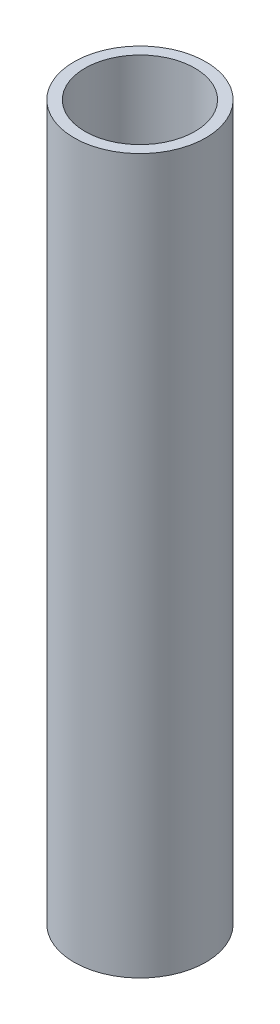
ISO-10303-21;
HEADER;
FILE_DESCRIPTION(('STEP AP214'),'2;1');
FILE_NAME('part.step','',(''),(''),'','','');
FILE_SCHEMA(('AUTOMOTIVE_DESIGN { 1 0 10303 214 1 1 1 1 }'));
ENDSEC;
DATA;
#1=APPLICATION_CONTEXT('core data for automotive mechanical design processes');
#2=APPLICATION_PROTOCOL_DEFINITION('international standard','automotive_design',2000,#1);
#3=PRODUCT_CONTEXT('',#1,'mechanical');
#4=PRODUCT('Part','Part','',(#3));
#5=PRODUCT_RELATED_PRODUCT_CATEGORY('part','',(#4));
#6=PRODUCT_DEFINITION_FORMATION('','',#4);
#7=PRODUCT_DEFINITION_CONTEXT('part definition',#1,'design');
#8=PRODUCT_DEFINITION('design','',#6,#7);
#9=PRODUCT_DEFINITION_SHAPE('','',#8);
#10=(LENGTH_UNIT() NAMED_UNIT(*) SI_UNIT(.MILLI.,.METRE.));
#11=(NAMED_UNIT(*) PLANE_ANGLE_UNIT() SI_UNIT($,.RADIAN.));
#12=(NAMED_UNIT(*) SI_UNIT($,.STERADIAN.) SOLID_ANGLE_UNIT());
#13=UNCERTAINTY_MEASURE_WITH_UNIT(LENGTH_MEASURE(1.E-05),#10,'distance_accuracy_value','');
#14=(GEOMETRIC_REPRESENTATION_CONTEXT(3) GLOBAL_UNCERTAINTY_ASSIGNED_CONTEXT((#13)) GLOBAL_UNIT_ASSIGNED_CONTEXT((#10,
#11,#12)) REPRESENTATION_CONTEXT('',''));
#15=CARTESIAN_POINT('',(0.,0.,0.));
#16=DIRECTION('',(0.,0.,1.));
#17=DIRECTION('',(1.,0.,0.));
#18=AXIS2_PLACEMENT_3D('',#15,#16,#17);
#19=CARTESIAN_POINT('',(0.,32.5,0.));
#20=DIRECTION('',(0.,1.,0.));
#21=DIRECTION('',(0.,0.,1.));
#22=AXIS2_PLACEMENT_3D('',#19,#20,#21);
#23=PLANE('',#22);
#24=CARTESIAN_POINT('',(0.,32.5,0.));
#25=DIRECTION('',(0.,1.,0.));
#26=DIRECTION('',(0.,0.,1.));
#27=AXIS2_PLACEMENT_3D('',#24,#25,#26);
#28=CIRCLE('',#27,3.);
#29=CARTESIAN_POINT('',(0.,32.5,3.));
#30=VERTEX_POINT('',#29);
#31=EDGE_CURVE('E10',#30,#30,#28,.T.);
#32=ORIENTED_EDGE('',*,*,#31,.T.);
#33=EDGE_LOOP('',(#32));
#34=FACE_BOUND('',#33,.T.);
#35=CARTESIAN_POINT('',(0.,32.5,0.));
#36=DIRECTION('',(0.,1.,0.));
#37=DIRECTION('',(0.,0.,1.));
#38=AXIS2_PLACEMENT_3D('',#35,#36,#37);
#39=CIRCLE('',#38,2.5);
#40=CARTESIAN_POINT('',(0.,32.5,2.5));
#41=VERTEX_POINT('',#40);
#42=EDGE_CURVE('E56',#41,#41,#39,.T.);
#43=ORIENTED_EDGE('',*,*,#42,.F.);
#44=EDGE_LOOP('',(#43));
#45=FACE_BOUND('',#44,.T.);
#46=ADVANCED_FACE('F43',(#34,#45),#23,.T.);
#47=CARTESIAN_POINT('',(0.,0.,0.));
#48=DIRECTION('',(0.,1.,0.));
#49=DIRECTION('',(0.,0.,1.));
#50=AXIS2_PLACEMENT_3D('',#47,#48,#49);
#51=PLANE('',#50);
#52=CARTESIAN_POINT('',(0.,0.,0.));
#53=DIRECTION('',(0.,1.,0.));
#54=DIRECTION('',(0.,0.,1.));
#55=AXIS2_PLACEMENT_3D('',#52,#53,#54);
#56=CIRCLE('',#55,3.);
#57=CARTESIAN_POINT('',(0.,0.,3.));
#58=VERTEX_POINT('',#57);
#59=EDGE_CURVE('E47',#58,#58,#56,.T.);
#60=ORIENTED_EDGE('',*,*,#59,.F.);
#61=EDGE_LOOP('',(#60));
#62=FACE_BOUND('',#61,.T.);
#63=CARTESIAN_POINT('',(0.,0.,0.));
#64=DIRECTION('',(0.,1.,0.));
#65=DIRECTION('',(0.,0.,1.));
#66=AXIS2_PLACEMENT_3D('',#63,#64,#65);
#67=CIRCLE('',#66,2.5);
#68=CARTESIAN_POINT('',(0.,0.,2.5));
#69=VERTEX_POINT('',#68);
#70=EDGE_CURVE('E58',#69,#69,#67,.T.);
#71=ORIENTED_EDGE('',*,*,#70,.T.);
#72=EDGE_LOOP('',(#71));
#73=FACE_BOUND('',#72,.T.);
#74=ADVANCED_FACE('F70',(#62,#73),#51,.F.);
#75=CARTESIAN_POINT('',(0.,32.5,0.));
#76=DIRECTION('',(0.,-1.,0.));
#77=DIRECTION('',(0.,0.,-1.));
#78=AXIS2_PLACEMENT_3D('',#75,#76,#77);
#79=CYLINDRICAL_SURFACE('',#78,3.);
#80=ORIENTED_EDGE('',*,*,#31,.F.);
#81=EDGE_LOOP('',(#80));
#82=FACE_BOUND('',#81,.T.);
#83=ORIENTED_EDGE('',*,*,#59,.T.);
#84=EDGE_LOOP('',(#83));
#85=FACE_BOUND('',#84,.T.);
#86=ADVANCED_FACE('F45',(#82,#85),#79,.T.);
#87=CARTESIAN_POINT('',(0.,32.5,0.));
#88=DIRECTION('',(0.,-1.,0.));
#89=DIRECTION('',(0.,0.,-1.));
#90=AXIS2_PLACEMENT_3D('',#87,#88,#89);
#91=CYLINDRICAL_SURFACE('',#90,2.5);
#92=ORIENTED_EDGE('',*,*,#42,.T.);
#93=EDGE_LOOP('',(#92));
#94=FACE_BOUND('',#93,.T.);
#95=ORIENTED_EDGE('',*,*,#70,.F.);
#96=EDGE_LOOP('',(#95));
#97=FACE_BOUND('',#96,.T.);
#98=ADVANCED_FACE('F66',(#94,#97),#91,.F.);
#99=CLOSED_SHELL('',(#46,#74,#86,#98));
#100=MANIFOLD_SOLID_BREP('B2',#99);
#101=ADVANCED_BREP_SHAPE_REPRESENTATION('',(#18,#100),#14);
#102=SHAPE_DEFINITION_REPRESENTATION(#9,#101);
ENDSEC;
END-ISO-10303-21;
